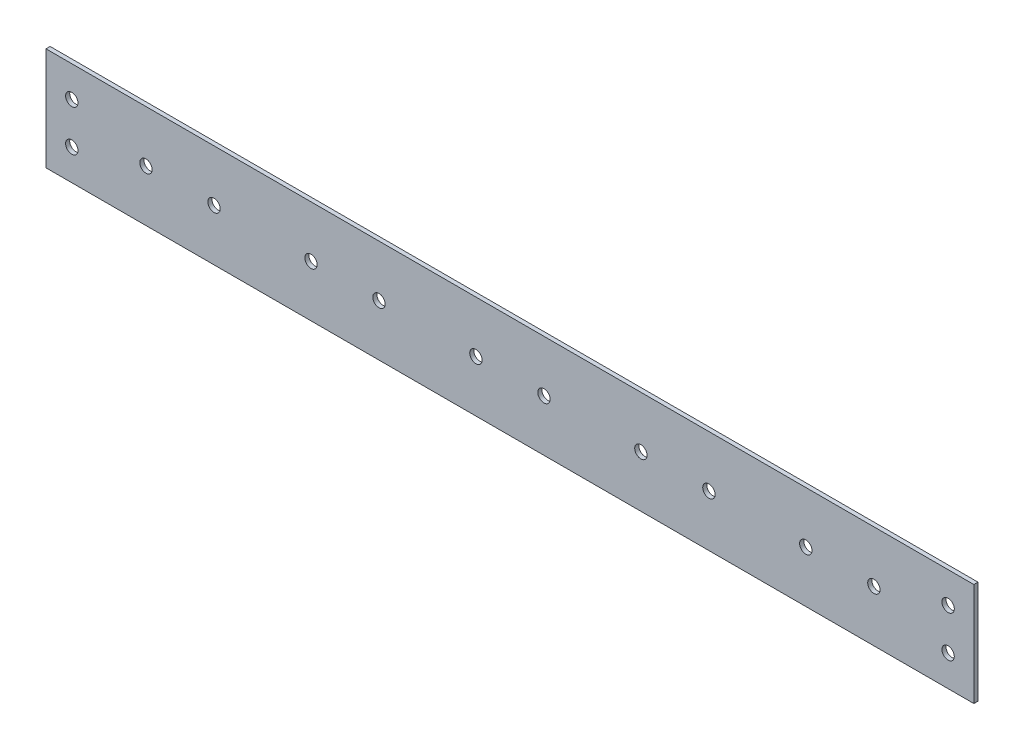
ISO-10303-21;
HEADER;
FILE_DESCRIPTION(('STEP AP214'),'2;1');
FILE_NAME('part.step','',(''),(''),'','','');
FILE_SCHEMA(('AUTOMOTIVE_DESIGN { 1 0 10303 214 1 1 1 1 }'));
ENDSEC;
DATA;
#1=APPLICATION_CONTEXT('core data for automotive mechanical design processes');
#2=APPLICATION_PROTOCOL_DEFINITION('international standard','automotive_design',2000,#1);
#3=PRODUCT_CONTEXT('',#1,'mechanical');
#4=PRODUCT('Part','Part','',(#3));
#5=PRODUCT_RELATED_PRODUCT_CATEGORY('part','',(#4));
#6=PRODUCT_DEFINITION_FORMATION('','',#4);
#7=PRODUCT_DEFINITION_CONTEXT('part definition',#1,'design');
#8=PRODUCT_DEFINITION('design','',#6,#7);
#9=PRODUCT_DEFINITION_SHAPE('','',#8);
#10=(LENGTH_UNIT() NAMED_UNIT(*) SI_UNIT(.MILLI.,.METRE.));
#11=(NAMED_UNIT(*) PLANE_ANGLE_UNIT() SI_UNIT($,.RADIAN.));
#12=(NAMED_UNIT(*) SI_UNIT($,.STERADIAN.) SOLID_ANGLE_UNIT());
#13=UNCERTAINTY_MEASURE_WITH_UNIT(LENGTH_MEASURE(1.E-05),#10,'distance_accuracy_value','');
#14=(GEOMETRIC_REPRESENTATION_CONTEXT(3) GLOBAL_UNCERTAINTY_ASSIGNED_CONTEXT((#13)) GLOBAL_UNIT_ASSIGNED_CONTEXT((#10,
#11,#12)) REPRESENTATION_CONTEXT('',''));
#15=CARTESIAN_POINT('',(0.,0.,0.));
#16=DIRECTION('',(0.,0.,1.));
#17=DIRECTION('',(1.,0.,0.));
#18=AXIS2_PLACEMENT_3D('',#15,#16,#17);
#19=CARTESIAN_POINT('',(0.,0.,2.));
#20=DIRECTION('',(0.,0.,1.));
#21=DIRECTION('',(1.,0.,0.));
#22=AXIS2_PLACEMENT_3D('',#19,#20,#21);
#23=PLANE('',#22);
#24=CARTESIAN_POINT('',(383.641952991417,7.39776951672886,2.));
#25=DIRECTION('',(0.,0.,1.));
#26=DIRECTION('',(-1.,0.,0.));
#27=AXIS2_PLACEMENT_3D('',#24,#25,#26);
#28=CIRCLE('',#27,2.99999999999999);
#29=CARTESIAN_POINT('',(380.641952991417,7.39776951672886,2.));
#30=VERTEX_POINT('',#29);
#31=EDGE_CURVE('E178',#30,#30,#28,.T.);
#32=ORIENTED_EDGE('',*,*,#31,.F.);
#33=EDGE_LOOP('',(#32));
#34=FACE_BOUND('',#33,.T.);
#35=CARTESIAN_POINT('',(383.641952991417,-12.6022304832711,2.));
#36=DIRECTION('',(0.,0.,1.));
#37=DIRECTION('',(1.,0.,0.));
#38=AXIS2_PLACEMENT_3D('',#35,#36,#37);
#39=CIRCLE('',#38,2.99999999999999);
#40=CARTESIAN_POINT('',(386.641952991417,-12.6022304832711,2.));
#41=VERTEX_POINT('',#40);
#42=EDGE_CURVE('E184',#41,#41,#39,.T.);
#43=ORIENTED_EDGE('',*,*,#42,.F.);
#44=EDGE_LOOP('',(#43));
#45=FACE_BOUND('',#44,.T.);
#46=CARTESIAN_POINT('',(-41.3580470085834,-12.6022304832714,2.));
#47=DIRECTION('',(0.,0.,1.));
#48=DIRECTION('',(-1.,0.,0.));
#49=AXIS2_PLACEMENT_3D('',#46,#47,#48);
#50=CIRCLE('',#49,3.);
#51=CARTESIAN_POINT('',(-44.3580470085834,-12.6022304832714,2.));
#52=VERTEX_POINT('',#51);
#53=EDGE_CURVE('E190',#52,#52,#50,.T.);
#54=ORIENTED_EDGE('',*,*,#53,.F.);
#55=EDGE_LOOP('',(#54));
#56=FACE_BOUND('',#55,.T.);
#57=CARTESIAN_POINT('',(-41.3580470085834,7.39776951672862,2.));
#58=DIRECTION('',(0.,0.,1.));
#59=DIRECTION('',(1.,0.,0.));
#60=AXIS2_PLACEMENT_3D('',#57,#58,#59);
#61=CIRCLE('',#60,3.);
#62=CARTESIAN_POINT('',(-38.3580470085834,7.39776951672862,2.));
#63=VERTEX_POINT('',#62);
#64=EDGE_CURVE('E172',#63,#63,#61,.T.);
#65=ORIENTED_EDGE('',*,*,#64,.F.);
#66=EDGE_LOOP('',(#65));
#67=FACE_BOUND('',#66,.T.);
#68=CARTESIAN_POINT('',(314.641952991417,-2.60223048327138,2.));
#69=DIRECTION('',(0.,0.,1.));
#70=DIRECTION('',(1.,0.,0.));
#71=AXIS2_PLACEMENT_3D('',#68,#69,#70);
#72=CIRCLE('',#71,2.99999999999999);
#73=CARTESIAN_POINT('',(317.641952991417,-2.60223048327138,2.));
#74=VERTEX_POINT('',#73);
#75=EDGE_CURVE('E157',#74,#74,#72,.T.);
#76=ORIENTED_EDGE('',*,*,#75,.F.);
#77=EDGE_LOOP('',(#76));
#78=FACE_BOUND('',#77,.T.);
#79=CARTESIAN_POINT('',(234.641952991417,-2.60223048327138,2.));
#80=DIRECTION('',(0.,0.,1.));
#81=DIRECTION('',(1.,0.,0.));
#82=AXIS2_PLACEMENT_3D('',#79,#80,#81);
#83=CIRCLE('',#82,2.99999999999999);
#84=CARTESIAN_POINT('',(237.641952991417,-2.60223048327138,2.));
#85=VERTEX_POINT('',#84);
#86=EDGE_CURVE('E145',#85,#85,#83,.T.);
#87=ORIENTED_EDGE('',*,*,#86,.F.);
#88=EDGE_LOOP('',(#87));
#89=FACE_BOUND('',#88,.T.);
#90=CARTESIAN_POINT('',(154.641952991417,-2.60223048327138,2.));
#91=DIRECTION('',(0.,0.,1.));
#92=DIRECTION('',(1.,0.,0.));
#93=AXIS2_PLACEMENT_3D('',#90,#91,#92);
#94=CIRCLE('',#93,3.00000000000002);
#95=CARTESIAN_POINT('',(157.641952991417,-2.60223048327138,2.));
#96=VERTEX_POINT('',#95);
#97=EDGE_CURVE('E133',#96,#96,#94,.T.);
#98=ORIENTED_EDGE('',*,*,#97,.F.);
#99=EDGE_LOOP('',(#98));
#100=FACE_BOUND('',#99,.T.);
#101=CARTESIAN_POINT('',(74.6419529914166,-2.60223048327138,2.));
#102=DIRECTION('',(0.,0.,1.));
#103=DIRECTION('',(1.,0.,0.));
#104=AXIS2_PLACEMENT_3D('',#101,#102,#103);
#105=CIRCLE('',#104,3.00000000000001);
#106=CARTESIAN_POINT('',(77.6419529914166,-2.60223048327138,2.));
#107=VERTEX_POINT('',#106);
#108=EDGE_CURVE('E121',#107,#107,#105,.T.);
#109=ORIENTED_EDGE('',*,*,#108,.F.);
#110=EDGE_LOOP('',(#109));
#111=FACE_BOUND('',#110,.T.);
#112=CARTESIAN_POINT('',(-5.35804700858336,-2.60223048327138,2.));
#113=DIRECTION('',(0.,0.,1.));
#114=DIRECTION('',(1.,0.,0.));
#115=AXIS2_PLACEMENT_3D('',#112,#113,#114);
#116=CIRCLE('',#115,3.);
#117=CARTESIAN_POINT('',(-2.35804700858335,-2.60223048327138,2.));
#118=VERTEX_POINT('',#117);
#119=EDGE_CURVE('E100',#118,#118,#116,.T.);
#120=ORIENTED_EDGE('',*,*,#119,.F.);
#121=EDGE_LOOP('',(#120));
#122=FACE_BOUND('',#121,.T.);
#123=DIRECTION('',(0.,-1.,0.));
#124=VECTOR('',#123,1.);
#125=CARTESIAN_POINT('',(-53.8580470085834,22.3977695167286,2.));
#126=LINE('',#125,#124);
#127=CARTESIAN_POINT('',(-53.8580470085834,22.3977695167286,2.));
#128=VERTEX_POINT('',#127);
#129=CARTESIAN_POINT('',(-53.8580470085834,-27.6022304832714,2.));
#130=VERTEX_POINT('',#129);
#131=EDGE_CURVE('E85',#128,#130,#126,.T.);
#132=ORIENTED_EDGE('',*,*,#131,.T.);
#133=DIRECTION('',(1.,0.,0.));
#134=VECTOR('',#133,1.);
#135=CARTESIAN_POINT('',(-53.8580470085834,-27.6022304832714,2.));
#136=LINE('',#135,#134);
#137=CARTESIAN_POINT('',(396.141952991417,-27.6022304832714,2.));
#138=VERTEX_POINT('',#137);
#139=EDGE_CURVE('E80',#130,#138,#136,.T.);
#140=ORIENTED_EDGE('',*,*,#139,.T.);
#141=DIRECTION('',(0.,1.,0.));
#142=VECTOR('',#141,1.);
#143=CARTESIAN_POINT('',(396.141952991417,22.3977695167286,2.));
#144=LINE('',#143,#142);
#145=CARTESIAN_POINT('',(396.141952991417,22.3977695167286,2.));
#146=VERTEX_POINT('',#145);
#147=EDGE_CURVE('E83',#138,#146,#144,.T.);
#148=ORIENTED_EDGE('',*,*,#147,.T.);
#149=DIRECTION('',(-1.,0.,0.));
#150=VECTOR('',#149,1.);
#151=CARTESIAN_POINT('',(-53.8580470085834,22.3977695167286,2.));
#152=LINE('',#151,#150);
#153=EDGE_CURVE('E50',#146,#128,#152,.T.);
#154=ORIENTED_EDGE('',*,*,#153,.T.);
#155=EDGE_LOOP('',(#132,#140,#148,#154));
#156=FACE_BOUND('',#155,.T.);
#157=CARTESIAN_POINT('',(27.6419529914166,-2.60223048327138,2.));
#158=DIRECTION('',(0.,0.,1.));
#159=DIRECTION('',(1.,0.,0.));
#160=AXIS2_PLACEMENT_3D('',#157,#158,#159);
#161=CIRCLE('',#160,3.00000000000001);
#162=CARTESIAN_POINT('',(30.6419529914167,-2.60223048327138,2.));
#163=VERTEX_POINT('',#162);
#164=EDGE_CURVE('E115',#163,#163,#161,.T.);
#165=ORIENTED_EDGE('',*,*,#164,.F.);
#166=EDGE_LOOP('',(#165));
#167=FACE_BOUND('',#166,.T.);
#168=CARTESIAN_POINT('',(107.641952991417,-2.60223048327138,2.));
#169=DIRECTION('',(0.,0.,1.));
#170=DIRECTION('',(1.,0.,0.));
#171=AXIS2_PLACEMENT_3D('',#168,#169,#170);
#172=CIRCLE('',#171,3.00000000000002);
#173=CARTESIAN_POINT('',(110.641952991417,-2.60223048327138,2.));
#174=VERTEX_POINT('',#173);
#175=EDGE_CURVE('E127',#174,#174,#172,.T.);
#176=ORIENTED_EDGE('',*,*,#175,.F.);
#177=EDGE_LOOP('',(#176));
#178=FACE_BOUND('',#177,.T.);
#179=CARTESIAN_POINT('',(187.641952991417,-2.60223048327138,2.));
#180=DIRECTION('',(0.,0.,1.));
#181=DIRECTION('',(1.,0.,0.));
#182=AXIS2_PLACEMENT_3D('',#179,#180,#181);
#183=CIRCLE('',#182,2.99999999999999);
#184=CARTESIAN_POINT('',(190.641952991417,-2.60223048327138,2.));
#185=VERTEX_POINT('',#184);
#186=EDGE_CURVE('E139',#185,#185,#183,.T.);
#187=ORIENTED_EDGE('',*,*,#186,.F.);
#188=EDGE_LOOP('',(#187));
#189=FACE_BOUND('',#188,.T.);
#190=CARTESIAN_POINT('',(267.641952991417,-2.60223048327138,2.));
#191=DIRECTION('',(0.,0.,1.));
#192=DIRECTION('',(1.,0.,0.));
#193=AXIS2_PLACEMENT_3D('',#190,#191,#192);
#194=CIRCLE('',#193,3.00000000000005);
#195=CARTESIAN_POINT('',(270.641952991417,-2.60223048327138,2.));
#196=VERTEX_POINT('',#195);
#197=EDGE_CURVE('E151',#196,#196,#194,.T.);
#198=ORIENTED_EDGE('',*,*,#197,.F.);
#199=EDGE_LOOP('',(#198));
#200=FACE_BOUND('',#199,.T.);
#201=CARTESIAN_POINT('',(347.641952991417,-2.60223048327138,2.));
#202=DIRECTION('',(0.,0.,1.));
#203=DIRECTION('',(1.,0.,0.));
#204=AXIS2_PLACEMENT_3D('',#201,#202,#203);
#205=CIRCLE('',#204,2.99999999999999);
#206=CARTESIAN_POINT('',(350.641952991417,-2.60223048327138,2.));
#207=VERTEX_POINT('',#206);
#208=EDGE_CURVE('E163',#207,#207,#205,.T.);
#209=ORIENTED_EDGE('',*,*,#208,.F.);
#210=EDGE_LOOP('',(#209));
#211=FACE_BOUND('',#210,.T.);
#212=ADVANCED_FACE('F33',(#34,#45,#56,#67,#78,#89,#100,#111,#122,#156,#167,#178,#189,#200,#211),
#23,.T.);
#213=CARTESIAN_POINT('',(0.,0.,0.));
#214=DIRECTION('',(0.,0.,1.));
#215=DIRECTION('',(1.,0.,0.));
#216=AXIS2_PLACEMENT_3D('',#213,#214,#215);
#217=PLANE('',#216);
#218=CARTESIAN_POINT('',(383.641952991417,7.39776951672886,0.));
#219=DIRECTION('',(0.,0.,1.));
#220=DIRECTION('',(-1.,0.,0.));
#221=AXIS2_PLACEMENT_3D('',#218,#219,#220);
#222=CIRCLE('',#221,2.99999999999999);
#223=CARTESIAN_POINT('',(380.641952991417,7.39776951672886,0.));
#224=VERTEX_POINT('',#223);
#225=EDGE_CURVE('E181',#224,#224,#222,.T.);
#226=ORIENTED_EDGE('',*,*,#225,.T.);
#227=EDGE_LOOP('',(#226));
#228=FACE_BOUND('',#227,.T.);
#229=CARTESIAN_POINT('',(383.641952991417,-12.6022304832711,0.));
#230=DIRECTION('',(0.,0.,1.));
#231=DIRECTION('',(1.,0.,0.));
#232=AXIS2_PLACEMENT_3D('',#229,#230,#231);
#233=CIRCLE('',#232,2.99999999999999);
#234=CARTESIAN_POINT('',(386.641952991417,-12.6022304832711,0.));
#235=VERTEX_POINT('',#234);
#236=EDGE_CURVE('E187',#235,#235,#233,.T.);
#237=ORIENTED_EDGE('',*,*,#236,.T.);
#238=EDGE_LOOP('',(#237));
#239=FACE_BOUND('',#238,.T.);
#240=CARTESIAN_POINT('',(-41.3580470085834,-12.6022304832714,0.));
#241=DIRECTION('',(0.,0.,1.));
#242=DIRECTION('',(-1.,0.,0.));
#243=AXIS2_PLACEMENT_3D('',#240,#241,#242);
#244=CIRCLE('',#243,3.);
#245=CARTESIAN_POINT('',(-44.3580470085834,-12.6022304832714,0.));
#246=VERTEX_POINT('',#245);
#247=EDGE_CURVE('E175',#246,#246,#244,.T.);
#248=ORIENTED_EDGE('',*,*,#247,.T.);
#249=EDGE_LOOP('',(#248));
#250=FACE_BOUND('',#249,.T.);
#251=CARTESIAN_POINT('',(-41.3580470085834,7.39776951672862,0.));
#252=DIRECTION('',(0.,0.,1.));
#253=DIRECTION('',(1.,0.,0.));
#254=AXIS2_PLACEMENT_3D('',#251,#252,#253);
#255=CIRCLE('',#254,3.);
#256=CARTESIAN_POINT('',(-38.3580470085834,7.39776951672862,0.));
#257=VERTEX_POINT('',#256);
#258=EDGE_CURVE('E169',#257,#257,#255,.T.);
#259=ORIENTED_EDGE('',*,*,#258,.T.);
#260=EDGE_LOOP('',(#259));
#261=FACE_BOUND('',#260,.T.);
#262=DIRECTION('',(0.,-1.,0.));
#263=VECTOR('',#262,1.);
#264=CARTESIAN_POINT('',(-53.8580470085834,22.3977695167286,0.));
#265=LINE('',#264,#263);
#266=CARTESIAN_POINT('',(-53.8580470085834,22.3977695167286,0.));
#267=VERTEX_POINT('',#266);
#268=CARTESIAN_POINT('',(-53.8580470085834,-27.6022304832714,0.));
#269=VERTEX_POINT('',#268);
#270=EDGE_CURVE('E97',#267,#269,#265,.T.);
#271=ORIENTED_EDGE('',*,*,#270,.F.);
#272=DIRECTION('',(-1.,0.,0.));
#273=VECTOR('',#272,1.);
#274=CARTESIAN_POINT('',(-53.8580470085834,22.3977695167286,0.));
#275=LINE('',#274,#273);
#276=CARTESIAN_POINT('',(396.141952991417,22.3977695167286,0.));
#277=VERTEX_POINT('',#276);
#278=EDGE_CURVE('E73',#277,#267,#275,.T.);
#279=ORIENTED_EDGE('',*,*,#278,.F.);
#280=DIRECTION('',(0.,1.,0.));
#281=VECTOR('',#280,1.);
#282=CARTESIAN_POINT('',(396.141952991417,22.3977695167286,0.));
#283=LINE('',#282,#281);
#284=CARTESIAN_POINT('',(396.141952991417,-27.6022304832714,0.));
#285=VERTEX_POINT('',#284);
#286=EDGE_CURVE('E67',#285,#277,#283,.T.);
#287=ORIENTED_EDGE('',*,*,#286,.F.);
#288=DIRECTION('',(1.,0.,0.));
#289=VECTOR('',#288,1.);
#290=CARTESIAN_POINT('',(-53.8580470085834,-27.6022304832714,0.));
#291=LINE('',#290,#289);
#292=EDGE_CURVE('E89',#269,#285,#291,.T.);
#293=ORIENTED_EDGE('',*,*,#292,.F.);
#294=EDGE_LOOP('',(#271,#279,#287,#293));
#295=FACE_BOUND('',#294,.T.);
#296=CARTESIAN_POINT('',(-5.35804700858336,-2.60223048327138,0.));
#297=DIRECTION('',(0.,0.,1.));
#298=DIRECTION('',(1.,0.,0.));
#299=AXIS2_PLACEMENT_3D('',#296,#297,#298);
#300=CIRCLE('',#299,3.);
#301=CARTESIAN_POINT('',(-2.35804700858335,-2.60223048327138,0.));
#302=VERTEX_POINT('',#301);
#303=EDGE_CURVE('E112',#302,#302,#300,.T.);
#304=ORIENTED_EDGE('',*,*,#303,.T.);
#305=EDGE_LOOP('',(#304));
#306=FACE_BOUND('',#305,.T.);
#307=CARTESIAN_POINT('',(27.6419529914166,-2.60223048327138,0.));
#308=DIRECTION('',(0.,0.,1.));
#309=DIRECTION('',(1.,0.,0.));
#310=AXIS2_PLACEMENT_3D('',#307,#308,#309);
#311=CIRCLE('',#310,3.00000000000001);
#312=CARTESIAN_POINT('',(30.6419529914167,-2.60223048327138,0.));
#313=VERTEX_POINT('',#312);
#314=EDGE_CURVE('E118',#313,#313,#311,.T.);
#315=ORIENTED_EDGE('',*,*,#314,.T.);
#316=EDGE_LOOP('',(#315));
#317=FACE_BOUND('',#316,.T.);
#318=CARTESIAN_POINT('',(74.6419529914166,-2.60223048327138,0.));
#319=DIRECTION('',(0.,0.,1.));
#320=DIRECTION('',(1.,0.,0.));
#321=AXIS2_PLACEMENT_3D('',#318,#319,#320);
#322=CIRCLE('',#321,3.00000000000001);
#323=CARTESIAN_POINT('',(77.6419529914166,-2.60223048327138,0.));
#324=VERTEX_POINT('',#323);
#325=EDGE_CURVE('E124',#324,#324,#322,.T.);
#326=ORIENTED_EDGE('',*,*,#325,.T.);
#327=EDGE_LOOP('',(#326));
#328=FACE_BOUND('',#327,.T.);
#329=CARTESIAN_POINT('',(107.641952991417,-2.60223048327138,0.));
#330=DIRECTION('',(0.,0.,1.));
#331=DIRECTION('',(1.,0.,0.));
#332=AXIS2_PLACEMENT_3D('',#329,#330,#331);
#333=CIRCLE('',#332,3.00000000000002);
#334=CARTESIAN_POINT('',(110.641952991417,-2.60223048327138,0.));
#335=VERTEX_POINT('',#334);
#336=EDGE_CURVE('E130',#335,#335,#333,.T.);
#337=ORIENTED_EDGE('',*,*,#336,.T.);
#338=EDGE_LOOP('',(#337));
#339=FACE_BOUND('',#338,.T.);
#340=CARTESIAN_POINT('',(154.641952991417,-2.60223048327138,0.));
#341=DIRECTION('',(0.,0.,1.));
#342=DIRECTION('',(1.,0.,0.));
#343=AXIS2_PLACEMENT_3D('',#340,#341,#342);
#344=CIRCLE('',#343,3.00000000000002);
#345=CARTESIAN_POINT('',(157.641952991417,-2.60223048327138,0.));
#346=VERTEX_POINT('',#345);
#347=EDGE_CURVE('E136',#346,#346,#344,.T.);
#348=ORIENTED_EDGE('',*,*,#347,.T.);
#349=EDGE_LOOP('',(#348));
#350=FACE_BOUND('',#349,.T.);
#351=CARTESIAN_POINT('',(187.641952991417,-2.60223048327138,0.));
#352=DIRECTION('',(0.,0.,1.));
#353=DIRECTION('',(1.,0.,0.));
#354=AXIS2_PLACEMENT_3D('',#351,#352,#353);
#355=CIRCLE('',#354,2.99999999999999);
#356=CARTESIAN_POINT('',(190.641952991417,-2.60223048327138,0.));
#357=VERTEX_POINT('',#356);
#358=EDGE_CURVE('E142',#357,#357,#355,.T.);
#359=ORIENTED_EDGE('',*,*,#358,.T.);
#360=EDGE_LOOP('',(#359));
#361=FACE_BOUND('',#360,.T.);
#362=CARTESIAN_POINT('',(234.641952991417,-2.60223048327138,0.));
#363=DIRECTION('',(0.,0.,1.));
#364=DIRECTION('',(1.,0.,0.));
#365=AXIS2_PLACEMENT_3D('',#362,#363,#364);
#366=CIRCLE('',#365,2.99999999999999);
#367=CARTESIAN_POINT('',(237.641952991417,-2.60223048327138,0.));
#368=VERTEX_POINT('',#367);
#369=EDGE_CURVE('E148',#368,#368,#366,.T.);
#370=ORIENTED_EDGE('',*,*,#369,.T.);
#371=EDGE_LOOP('',(#370));
#372=FACE_BOUND('',#371,.T.);
#373=CARTESIAN_POINT('',(267.641952991417,-2.60223048327138,0.));
#374=DIRECTION('',(0.,0.,1.));
#375=DIRECTION('',(1.,0.,0.));
#376=AXIS2_PLACEMENT_3D('',#373,#374,#375);
#377=CIRCLE('',#376,3.00000000000005);
#378=CARTESIAN_POINT('',(270.641952991417,-2.60223048327138,0.));
#379=VERTEX_POINT('',#378);
#380=EDGE_CURVE('E154',#379,#379,#377,.T.);
#381=ORIENTED_EDGE('',*,*,#380,.T.);
#382=EDGE_LOOP('',(#381));
#383=FACE_BOUND('',#382,.T.);
#384=CARTESIAN_POINT('',(314.641952991417,-2.60223048327138,0.));
#385=DIRECTION('',(0.,0.,1.));
#386=DIRECTION('',(1.,0.,0.));
#387=AXIS2_PLACEMENT_3D('',#384,#385,#386);
#388=CIRCLE('',#387,2.99999999999999);
#389=CARTESIAN_POINT('',(317.641952991417,-2.60223048327138,0.));
#390=VERTEX_POINT('',#389);
#391=EDGE_CURVE('E160',#390,#390,#388,.T.);
#392=ORIENTED_EDGE('',*,*,#391,.T.);
#393=EDGE_LOOP('',(#392));
#394=FACE_BOUND('',#393,.T.);
#395=CARTESIAN_POINT('',(347.641952991417,-2.60223048327138,0.));
#396=DIRECTION('',(0.,0.,1.));
#397=DIRECTION('',(1.,0.,0.));
#398=AXIS2_PLACEMENT_3D('',#395,#396,#397);
#399=CIRCLE('',#398,2.99999999999999);
#400=CARTESIAN_POINT('',(350.641952991417,-2.60223048327138,0.));
#401=VERTEX_POINT('',#400);
#402=EDGE_CURVE('E166',#401,#401,#399,.T.);
#403=ORIENTED_EDGE('',*,*,#402,.T.);
#404=EDGE_LOOP('',(#403));
#405=FACE_BOUND('',#404,.T.);
#406=ADVANCED_FACE('F108',(#228,#239,#250,#261,#295,#306,#317,#328,#339,#350,#361,#372,#383,
#394,#405),#217,.F.);
#407=CARTESIAN_POINT('',(-53.8580470085834,22.3977695167286,2.));
#408=DIRECTION('',(1.,0.,0.));
#409=DIRECTION('',(0.,0.,-1.));
#410=AXIS2_PLACEMENT_3D('',#407,#408,#409);
#411=PLANE('',#410);
#412=ORIENTED_EDGE('',*,*,#270,.T.);
#413=DIRECTION('',(0.,0.,-1.));
#414=VECTOR('',#413,1.);
#415=CARTESIAN_POINT('',(-53.8580470085834,-27.6022304832714,2.));
#416=LINE('',#415,#414);
#417=EDGE_CURVE('E11',#130,#269,#416,.T.);
#418=ORIENTED_EDGE('',*,*,#417,.F.);
#419=ORIENTED_EDGE('',*,*,#131,.F.);
#420=DIRECTION('',(0.,0.,-1.));
#421=VECTOR('',#420,1.);
#422=CARTESIAN_POINT('',(-53.8580470085834,22.3977695167286,2.));
#423=LINE('',#422,#421);
#424=EDGE_CURVE('E93',#128,#267,#423,.T.);
#425=ORIENTED_EDGE('',*,*,#424,.T.);
#426=EDGE_LOOP('',(#412,#418,#419,#425));
#427=FACE_BOUND('',#426,.T.);
#428=ADVANCED_FACE('F35',(#427),#411,.F.);
#429=CARTESIAN_POINT('',(-53.8580470085834,-27.6022304832714,2.));
#430=DIRECTION('',(0.,1.,0.));
#431=DIRECTION('',(-1.,0.,0.));
#432=AXIS2_PLACEMENT_3D('',#429,#430,#431);
#433=PLANE('',#432);
#434=ORIENTED_EDGE('',*,*,#292,.T.);
#435=DIRECTION('',(0.,0.,-1.));
#436=VECTOR('',#435,1.);
#437=CARTESIAN_POINT('',(396.141952991417,-27.6022304832714,2.));
#438=LINE('',#437,#436);
#439=EDGE_CURVE('E42',#138,#285,#438,.T.);
#440=ORIENTED_EDGE('',*,*,#439,.F.);
#441=ORIENTED_EDGE('',*,*,#139,.F.);
#442=ORIENTED_EDGE('',*,*,#417,.T.);
#443=EDGE_LOOP('',(#434,#440,#441,#442));
#444=FACE_BOUND('',#443,.T.);
#445=ADVANCED_FACE('F88',(#444),#433,.F.);
#446=CARTESIAN_POINT('',(396.141952991417,22.3977695167286,2.));
#447=DIRECTION('',(-1.,0.,0.));
#448=DIRECTION('',(0.,0.,1.));
#449=AXIS2_PLACEMENT_3D('',#446,#447,#448);
#450=PLANE('',#449);
#451=ORIENTED_EDGE('',*,*,#286,.T.);
#452=DIRECTION('',(0.,0.,-1.));
#453=VECTOR('',#452,1.);
#454=CARTESIAN_POINT('',(396.141952991417,22.3977695167286,2.));
#455=LINE('',#454,#453);
#456=EDGE_CURVE('E90',#146,#277,#455,.T.);
#457=ORIENTED_EDGE('',*,*,#456,.F.);
#458=ORIENTED_EDGE('',*,*,#147,.F.);
#459=ORIENTED_EDGE('',*,*,#439,.T.);
#460=EDGE_LOOP('',(#451,#457,#458,#459));
#461=FACE_BOUND('',#460,.T.);
#462=ADVANCED_FACE('F91',(#461),#450,.F.);
#463=CARTESIAN_POINT('',(-53.8580470085834,22.3977695167286,2.));
#464=DIRECTION('',(0.,-1.,0.));
#465=DIRECTION('',(0.,0.,-1.));
#466=AXIS2_PLACEMENT_3D('',#463,#464,#465);
#467=PLANE('',#466);
#468=ORIENTED_EDGE('',*,*,#278,.T.);
#469=ORIENTED_EDGE('',*,*,#424,.F.);
#470=ORIENTED_EDGE('',*,*,#153,.F.);
#471=ORIENTED_EDGE('',*,*,#456,.T.);
#472=EDGE_LOOP('',(#468,#469,#470,#471));
#473=FACE_BOUND('',#472,.T.);
#474=ADVANCED_FACE('F105',(#473),#467,.F.);
#475=CARTESIAN_POINT('',(-5.35804700858336,-2.60223048327138,2.));
#476=DIRECTION('',(0.,0.,-1.));
#477=DIRECTION('',(-1.,0.,0.));
#478=AXIS2_PLACEMENT_3D('',#475,#476,#477);
#479=CYLINDRICAL_SURFACE('',#478,3.);
#480=ORIENTED_EDGE('',*,*,#119,.T.);
#481=EDGE_LOOP('',(#480));
#482=FACE_BOUND('',#481,.T.);
#483=ORIENTED_EDGE('',*,*,#303,.F.);
#484=EDGE_LOOP('',(#483));
#485=FACE_BOUND('',#484,.T.);
#486=ADVANCED_FACE('F222',(#482,#485),#479,.F.);
#487=CARTESIAN_POINT('',(27.6419529914166,-2.60223048327138,2.));
#488=DIRECTION('',(0.,0.,-1.));
#489=DIRECTION('',(-1.,0.,0.));
#490=AXIS2_PLACEMENT_3D('',#487,#488,#489);
#491=CYLINDRICAL_SURFACE('',#490,3.00000000000001);
#492=ORIENTED_EDGE('',*,*,#164,.T.);
#493=EDGE_LOOP('',(#492));
#494=FACE_BOUND('',#493,.T.);
#495=ORIENTED_EDGE('',*,*,#314,.F.);
#496=EDGE_LOOP('',(#495));
#497=FACE_BOUND('',#496,.T.);
#498=ADVANCED_FACE('F225',(#494,#497),#491,.F.);
#499=CARTESIAN_POINT('',(74.6419529914166,-2.60223048327138,2.));
#500=DIRECTION('',(0.,0.,-1.));
#501=DIRECTION('',(-1.,0.,0.));
#502=AXIS2_PLACEMENT_3D('',#499,#500,#501);
#503=CYLINDRICAL_SURFACE('',#502,3.00000000000001);
#504=ORIENTED_EDGE('',*,*,#108,.T.);
#505=EDGE_LOOP('',(#504));
#506=FACE_BOUND('',#505,.T.);
#507=ORIENTED_EDGE('',*,*,#325,.F.);
#508=EDGE_LOOP('',(#507));
#509=FACE_BOUND('',#508,.T.);
#510=ADVANCED_FACE('F284',(#506,#509),#503,.F.);
#511=CARTESIAN_POINT('',(107.641952991417,-2.60223048327138,2.));
#512=DIRECTION('',(0.,0.,-1.));
#513=DIRECTION('',(-1.,0.,0.));
#514=AXIS2_PLACEMENT_3D('',#511,#512,#513);
#515=CYLINDRICAL_SURFACE('',#514,3.00000000000002);
#516=ORIENTED_EDGE('',*,*,#175,.T.);
#517=EDGE_LOOP('',(#516));
#518=FACE_BOUND('',#517,.T.);
#519=ORIENTED_EDGE('',*,*,#336,.F.);
#520=EDGE_LOOP('',(#519));
#521=FACE_BOUND('',#520,.T.);
#522=ADVANCED_FACE('F280',(#518,#521),#515,.F.);
#523=CARTESIAN_POINT('',(154.641952991417,-2.60223048327138,2.));
#524=DIRECTION('',(0.,0.,-1.));
#525=DIRECTION('',(-1.,0.,0.));
#526=AXIS2_PLACEMENT_3D('',#523,#524,#525);
#527=CYLINDRICAL_SURFACE('',#526,3.00000000000002);
#528=ORIENTED_EDGE('',*,*,#97,.T.);
#529=EDGE_LOOP('',(#528));
#530=FACE_BOUND('',#529,.T.);
#531=ORIENTED_EDGE('',*,*,#347,.F.);
#532=EDGE_LOOP('',(#531));
#533=FACE_BOUND('',#532,.T.);
#534=ADVANCED_FACE('F276',(#530,#533),#527,.F.);
#535=CARTESIAN_POINT('',(187.641952991417,-2.60223048327138,2.));
#536=DIRECTION('',(0.,0.,-1.));
#537=DIRECTION('',(-1.,0.,0.));
#538=AXIS2_PLACEMENT_3D('',#535,#536,#537);
#539=CYLINDRICAL_SURFACE('',#538,2.99999999999999);
#540=ORIENTED_EDGE('',*,*,#186,.T.);
#541=EDGE_LOOP('',(#540));
#542=FACE_BOUND('',#541,.T.);
#543=ORIENTED_EDGE('',*,*,#358,.F.);
#544=EDGE_LOOP('',(#543));
#545=FACE_BOUND('',#544,.T.);
#546=ADVANCED_FACE('F272',(#542,#545),#539,.F.);
#547=CARTESIAN_POINT('',(234.641952991417,-2.60223048327138,2.));
#548=DIRECTION('',(0.,0.,-1.));
#549=DIRECTION('',(-1.,0.,0.));
#550=AXIS2_PLACEMENT_3D('',#547,#548,#549);
#551=CYLINDRICAL_SURFACE('',#550,2.99999999999999);
#552=ORIENTED_EDGE('',*,*,#86,.T.);
#553=EDGE_LOOP('',(#552));
#554=FACE_BOUND('',#553,.T.);
#555=ORIENTED_EDGE('',*,*,#369,.F.);
#556=EDGE_LOOP('',(#555));
#557=FACE_BOUND('',#556,.T.);
#558=ADVANCED_FACE('F268',(#554,#557),#551,.F.);
#559=CARTESIAN_POINT('',(267.641952991417,-2.60223048327138,2.));
#560=DIRECTION('',(0.,0.,-1.));
#561=DIRECTION('',(-1.,0.,0.));
#562=AXIS2_PLACEMENT_3D('',#559,#560,#561);
#563=CYLINDRICAL_SURFACE('',#562,3.00000000000005);
#564=ORIENTED_EDGE('',*,*,#197,.T.);
#565=EDGE_LOOP('',(#564));
#566=FACE_BOUND('',#565,.T.);
#567=ORIENTED_EDGE('',*,*,#380,.F.);
#568=EDGE_LOOP('',(#567));
#569=FACE_BOUND('',#568,.T.);
#570=ADVANCED_FACE('F261',(#566,#569),#563,.F.);
#571=CARTESIAN_POINT('',(314.641952991417,-2.60223048327138,2.));
#572=DIRECTION('',(0.,0.,-1.));
#573=DIRECTION('',(-1.,0.,0.));
#574=AXIS2_PLACEMENT_3D('',#571,#572,#573);
#575=CYLINDRICAL_SURFACE('',#574,2.99999999999999);
#576=ORIENTED_EDGE('',*,*,#75,.T.);
#577=EDGE_LOOP('',(#576));
#578=FACE_BOUND('',#577,.T.);
#579=ORIENTED_EDGE('',*,*,#391,.F.);
#580=EDGE_LOOP('',(#579));
#581=FACE_BOUND('',#580,.T.);
#582=ADVANCED_FACE('F252',(#578,#581),#575,.F.);
#583=CARTESIAN_POINT('',(347.641952991417,-2.60223048327138,2.));
#584=DIRECTION('',(0.,0.,-1.));
#585=DIRECTION('',(-1.,0.,0.));
#586=AXIS2_PLACEMENT_3D('',#583,#584,#585);
#587=CYLINDRICAL_SURFACE('',#586,2.99999999999999);
#588=ORIENTED_EDGE('',*,*,#208,.T.);
#589=EDGE_LOOP('',(#588));
#590=FACE_BOUND('',#589,.T.);
#591=ORIENTED_EDGE('',*,*,#402,.F.);
#592=EDGE_LOOP('',(#591));
#593=FACE_BOUND('',#592,.T.);
#594=ADVANCED_FACE('F250',(#590,#593),#587,.F.);
#595=CARTESIAN_POINT('',(-41.3580470085834,7.39776951672862,0.));
#596=DIRECTION('',(0.,0.,1.));
#597=DIRECTION('',(1.,0.,0.));
#598=AXIS2_PLACEMENT_3D('',#595,#596,#597);
#599=CYLINDRICAL_SURFACE('',#598,3.);
#600=ORIENTED_EDGE('',*,*,#258,.F.);
#601=EDGE_LOOP('',(#600));
#602=FACE_BOUND('',#601,.T.);
#603=ORIENTED_EDGE('',*,*,#64,.T.);
#604=EDGE_LOOP('',(#603));
#605=FACE_BOUND('',#604,.T.);
#606=ADVANCED_FACE('F202',(#602,#605),#599,.F.);
#607=CARTESIAN_POINT('',(-41.3580470085834,-12.6022304832714,0.));
#608=DIRECTION('',(0.,0.,1.));
#609=DIRECTION('',(1.,0.,0.));
#610=AXIS2_PLACEMENT_3D('',#607,#608,#609);
#611=CYLINDRICAL_SURFACE('',#610,3.);
#612=ORIENTED_EDGE('',*,*,#247,.F.);
#613=EDGE_LOOP('',(#612));
#614=FACE_BOUND('',#613,.T.);
#615=ORIENTED_EDGE('',*,*,#53,.T.);
#616=EDGE_LOOP('',(#615));
#617=FACE_BOUND('',#616,.T.);
#618=ADVANCED_FACE('F198',(#614,#617),#611,.F.);
#619=CARTESIAN_POINT('',(383.641952991417,-12.6022304832711,0.));
#620=DIRECTION('',(0.,0.,1.));
#621=DIRECTION('',(1.,0.,0.));
#622=AXIS2_PLACEMENT_3D('',#619,#620,#621);
#623=CYLINDRICAL_SURFACE('',#622,2.99999999999999);
#624=ORIENTED_EDGE('',*,*,#236,.F.);
#625=EDGE_LOOP('',(#624));
#626=FACE_BOUND('',#625,.T.);
#627=ORIENTED_EDGE('',*,*,#42,.T.);
#628=EDGE_LOOP('',(#627));
#629=FACE_BOUND('',#628,.T.);
#630=ADVANCED_FACE('F201',(#626,#629),#623,.F.);
#631=CARTESIAN_POINT('',(383.641952991417,7.39776951672886,0.));
#632=DIRECTION('',(0.,0.,1.));
#633=DIRECTION('',(1.,0.,0.));
#634=AXIS2_PLACEMENT_3D('',#631,#632,#633);
#635=CYLINDRICAL_SURFACE('',#634,2.99999999999999);
#636=ORIENTED_EDGE('',*,*,#225,.F.);
#637=EDGE_LOOP('',(#636));
#638=FACE_BOUND('',#637,.T.);
#639=ORIENTED_EDGE('',*,*,#31,.T.);
#640=EDGE_LOOP('',(#639));
#641=FACE_BOUND('',#640,.T.);
#642=ADVANCED_FACE('F407',(#638,#641),#635,.F.);
#643=CLOSED_SHELL('',(#212,#406,#428,#445,#462,#474,#486,#498,#510,#522,#534,#546,#558,#570,
#582,#594,#606,#618,#630,#642));
#644=MANIFOLD_SOLID_BREP('B2',#643);
#645=ADVANCED_BREP_SHAPE_REPRESENTATION('',(#18,#644),#14);
#646=SHAPE_DEFINITION_REPRESENTATION(#9,#645);
ENDSEC;
END-ISO-10303-21;
